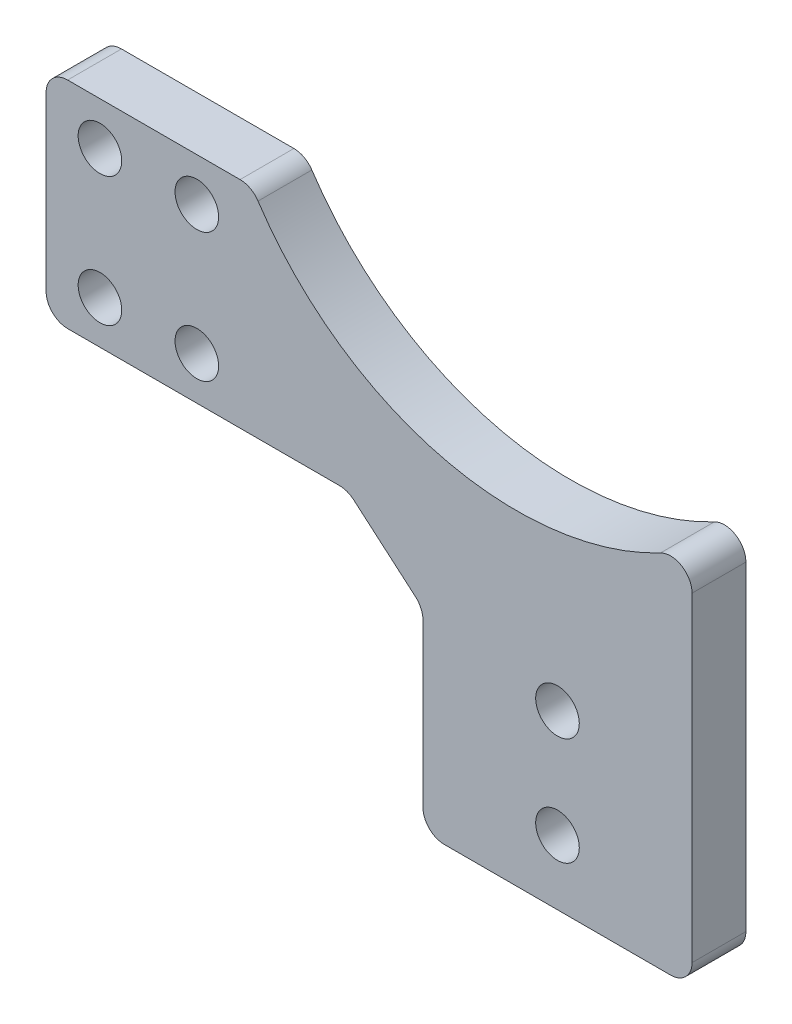
ISO-10303-21;
HEADER;
FILE_DESCRIPTION(('STEP AP214'),'2;1');
FILE_NAME('part.step','',(''),(''),'','','');
FILE_SCHEMA(('AUTOMOTIVE_DESIGN { 1 0 10303 214 1 1 1 1 }'));
ENDSEC;
DATA;
#1=APPLICATION_CONTEXT('core data for automotive mechanical design processes');
#2=APPLICATION_PROTOCOL_DEFINITION('international standard','automotive_design',2000,#1);
#3=PRODUCT_CONTEXT('',#1,'mechanical');
#4=PRODUCT('Part','Part','',(#3));
#5=PRODUCT_RELATED_PRODUCT_CATEGORY('part','',(#4));
#6=PRODUCT_DEFINITION_FORMATION('','',#4);
#7=PRODUCT_DEFINITION_CONTEXT('part definition',#1,'design');
#8=PRODUCT_DEFINITION('design','',#6,#7);
#9=PRODUCT_DEFINITION_SHAPE('','',#8);
#10=(LENGTH_UNIT() NAMED_UNIT(*) SI_UNIT(.MILLI.,.METRE.));
#11=(NAMED_UNIT(*) PLANE_ANGLE_UNIT() SI_UNIT($,.RADIAN.));
#12=(NAMED_UNIT(*) SI_UNIT($,.STERADIAN.) SOLID_ANGLE_UNIT());
#13=UNCERTAINTY_MEASURE_WITH_UNIT(LENGTH_MEASURE(1.E-05),#10,'distance_accuracy_value','');
#14=(GEOMETRIC_REPRESENTATION_CONTEXT(3) GLOBAL_UNCERTAINTY_ASSIGNED_CONTEXT((#13)) GLOBAL_UNIT_ASSIGNED_CONTEXT((#10,
#11,#12)) REPRESENTATION_CONTEXT('',''));
#15=CARTESIAN_POINT('',(0.,0.,0.));
#16=DIRECTION('',(0.,0.,1.));
#17=DIRECTION('',(1.,0.,0.));
#18=AXIS2_PLACEMENT_3D('',#15,#16,#17);
#19=CARTESIAN_POINT('',(-7.,6.,2.5));
#20=DIRECTION('',(0.650791373455969,0.759256602365296,0.));
#21=DIRECTION('',(-0.759256602365296,0.650791373455969,0.));
#22=AXIS2_PLACEMENT_3D('',#19,#20,#21);
#23=PLANE('',#22);
#24=DIRECTION('',(0.759256602365296,-0.650791373455969,0.));
#25=VECTOR('',#24,1.);
#26=CARTESIAN_POINT('',(-7.,6.,2.5));
#27=LINE('',#26,#25);
#28=CARTESIAN_POINT('',(-6.43826540551902,5.51851320473059,2.5));
#29=VERTEX_POINT('',#28);
#30=CARTESIAN_POINT('',(-0.698417253088064,0.598643359789769,2.5));
#31=VERTEX_POINT('',#30);
#32=EDGE_CURVE('E169',#29,#31,#27,.T.);
#33=ORIENTED_EDGE('',*,*,#32,.F.);
#34=DIRECTION('',(0.,0.,-1.));
#35=VECTOR('',#34,1.);
#36=CARTESIAN_POINT('',(-6.43826540551902,5.51851320473059,-2.5));
#37=LINE('',#36,#35);
#38=CARTESIAN_POINT('',(-6.43826540551902,5.51851320473059,-2.5));
#39=VERTEX_POINT('',#38);
#40=EDGE_CURVE('E155',#29,#39,#37,.T.);
#41=ORIENTED_EDGE('',*,*,#40,.T.);
#42=DIRECTION('',(0.759256602365296,-0.650791373455969,0.));
#43=VECTOR('',#42,1.);
#44=CARTESIAN_POINT('',(-7.,6.,-2.5));
#45=LINE('',#44,#43);
#46=CARTESIAN_POINT('',(-0.698417253088064,0.598643359789769,-2.5));
#47=VERTEX_POINT('',#46);
#48=EDGE_CURVE('E166',#39,#47,#45,.T.);
#49=ORIENTED_EDGE('',*,*,#48,.T.);
#50=DIRECTION('',(0.,0.,-1.));
#51=VECTOR('',#50,1.);
#52=CARTESIAN_POINT('',(-0.698417253088063,0.598643359789768,2.5));
#53=LINE('',#52,#51);
#54=EDGE_CURVE('E171',#47,#31,#53,.F.);
#55=ORIENTED_EDGE('',*,*,#54,.T.);
#56=EDGE_LOOP('',(#33,#41,#49,#55));
#57=FACE_BOUND('',#56,.T.);
#58=ADVANCED_FACE('F35',(#57),#23,.F.);
#59=CARTESIAN_POINT('',(0.,0.,2.5));
#60=DIRECTION('',(1.,0.,0.));
#61=DIRECTION('',(0.,1.,0.));
#62=AXIS2_PLACEMENT_3D('',#59,#60,#61);
#63=PLANE('',#62);
#64=DIRECTION('',(0.,-1.,0.));
#65=VECTOR('',#64,1.);
#66=CARTESIAN_POINT('',(0.,0.,-2.5));
#67=LINE('',#66,#65);
#68=CARTESIAN_POINT('',(0.,-0.919869844940825,-2.5));
#69=VERTEX_POINT('',#68);
#70=CARTESIAN_POINT('',(0.,-16.,-2.5));
#71=VERTEX_POINT('',#70);
#72=EDGE_CURVE('E176',#69,#71,#67,.T.);
#73=ORIENTED_EDGE('',*,*,#72,.T.);
#74=DIRECTION('',(0.,0.,1.));
#75=VECTOR('',#74,1.);
#76=CARTESIAN_POINT('',(0.,-16.,2.5));
#77=LINE('',#76,#75);
#78=CARTESIAN_POINT('',(0.,-16.,2.5));
#79=VERTEX_POINT('',#78);
#80=EDGE_CURVE('E11',#71,#79,#77,.T.);
#81=ORIENTED_EDGE('',*,*,#80,.T.);
#82=DIRECTION('',(0.,-1.,0.));
#83=VECTOR('',#82,1.);
#84=CARTESIAN_POINT('',(0.,0.,2.5));
#85=LINE('',#84,#83);
#86=CARTESIAN_POINT('',(0.,-0.919869844940825,2.5));
#87=VERTEX_POINT('',#86);
#88=EDGE_CURVE('E277',#87,#79,#85,.T.);
#89=ORIENTED_EDGE('',*,*,#88,.F.);
#90=DIRECTION('',(0.,0.,-1.));
#91=VECTOR('',#90,1.);
#92=CARTESIAN_POINT('',(0.,-0.919869844940825,-2.5));
#93=LINE('',#92,#91);
#94=EDGE_CURVE('E217',#87,#69,#93,.T.);
#95=ORIENTED_EDGE('',*,*,#94,.T.);
#96=EDGE_LOOP('',(#73,#81,#89,#95));
#97=FACE_BOUND('',#96,.T.);
#98=ADVANCED_FACE('F333',(#97),#63,.F.);
#99=CARTESIAN_POINT('',(25.,-24.,2.5));
#100=DIRECTION('',(-1.,0.,0.));
#101=DIRECTION('',(0.,-1.,0.));
#102=AXIS2_PLACEMENT_3D('',#99,#100,#101);
#103=PLANE('',#102);
#104=DIRECTION('',(0.,1.,0.));
#105=VECTOR('',#104,1.);
#106=CARTESIAN_POINT('',(25.,-24.,2.5));
#107=LINE('',#106,#105);
#108=CARTESIAN_POINT('',(25.,-16.,2.5));
#109=VERTEX_POINT('',#108);
#110=CARTESIAN_POINT('',(25.,13.7208871111981,2.5));
#111=VERTEX_POINT('',#110);
#112=EDGE_CURVE('E272',#109,#111,#107,.T.);
#113=ORIENTED_EDGE('',*,*,#112,.F.);
#114=DIRECTION('',(0.,0.,1.));
#115=VECTOR('',#114,1.);
#116=CARTESIAN_POINT('',(25.,-16.,2.5));
#117=LINE('',#116,#115);
#118=CARTESIAN_POINT('',(25.,-16.,-2.5));
#119=VERTEX_POINT('',#118);
#120=EDGE_CURVE('E58',#109,#119,#117,.F.);
#121=ORIENTED_EDGE('',*,*,#120,.T.);
#122=DIRECTION('',(0.,1.,0.));
#123=VECTOR('',#122,1.);
#124=CARTESIAN_POINT('',(25.,-24.,-2.5));
#125=LINE('',#124,#123);
#126=CARTESIAN_POINT('',(25.,13.7208871111981,-2.5));
#127=VERTEX_POINT('',#126);
#128=EDGE_CURVE('E179',#119,#127,#125,.T.);
#129=ORIENTED_EDGE('',*,*,#128,.T.);
#130=DIRECTION('',(0.,0.,-1.));
#131=VECTOR('',#130,1.);
#132=CARTESIAN_POINT('',(25.,13.7208871111981,2.5));
#133=LINE('',#132,#131);
#134=EDGE_CURVE('E236',#127,#111,#133,.F.);
#135=ORIENTED_EDGE('',*,*,#134,.T.);
#136=EDGE_LOOP('',(#113,#121,#129,#135));
#137=FACE_BOUND('',#136,.T.);
#138=ADVANCED_FACE('F273',(#137),#103,.F.);
#139=CARTESIAN_POINT('',(8.70000000000001,41.,2.5));
#140=DIRECTION('',(0.,0.,-1.));
#141=DIRECTION('',(-1.,0.,0.));
#142=AXIS2_PLACEMENT_3D('',#139,#140,#141);
#143=CYLINDRICAL_SURFACE('',#142,28.8);
#144=CARTESIAN_POINT('',(8.70000000000001,41.,2.5));
#145=DIRECTION('',(0.,0.,-1.));
#146=DIRECTION('',(-1.,0.,0.));
#147=AXIS2_PLACEMENT_3D('',#144,#145,#146);
#148=CIRCLE('',#147,28.8);
#149=CARTESIAN_POINT('',(22.0714285714286,15.4922580780034,2.5));
#150=VERTEX_POINT('',#149);
#151=CARTESIAN_POINT('',(-15.3157007169116,25.1038961038961,2.5));
#152=VERTEX_POINT('',#151);
#153=EDGE_CURVE('E276',#150,#152,#148,.T.);
#154=ORIENTED_EDGE('',*,*,#153,.F.);
#155=DIRECTION('',(0.,0.,-1.));
#156=VECTOR('',#155,1.);
#157=CARTESIAN_POINT('',(22.0714285714286,15.4922580780034,2.5));
#158=LINE('',#157,#156);
#159=CARTESIAN_POINT('',(22.0714285714286,15.4922580780034,-2.5));
#160=VERTEX_POINT('',#159);
#161=EDGE_CURVE('E228',#150,#160,#158,.T.);
#162=ORIENTED_EDGE('',*,*,#161,.T.);
#163=CARTESIAN_POINT('',(8.70000000000001,41.,-2.5));
#164=DIRECTION('',(0.,0.,-1.));
#165=DIRECTION('',(-1.,0.,0.));
#166=AXIS2_PLACEMENT_3D('',#163,#164,#165);
#167=CIRCLE('',#166,28.8);
#168=CARTESIAN_POINT('',(-15.3157007169116,25.1038961038961,-2.5));
#169=VERTEX_POINT('',#168);
#170=EDGE_CURVE('E189',#160,#169,#167,.T.);
#171=ORIENTED_EDGE('',*,*,#170,.T.);
#172=DIRECTION('',(0.,0.,-1.));
#173=VECTOR('',#172,1.);
#174=CARTESIAN_POINT('',(-15.3157007169116,25.1038961038961,2.5));
#175=LINE('',#174,#173);
#176=EDGE_CURVE('E226',#169,#152,#175,.F.);
#177=ORIENTED_EDGE('',*,*,#176,.T.);
#178=EDGE_LOOP('',(#154,#162,#171,#177));
#179=FACE_BOUND('',#178,.T.);
#180=ADVANCED_FACE('F318',(#179),#143,.F.);
#181=CARTESIAN_POINT('',(-15.8853614982575,26.,2.5));
#182=DIRECTION('',(0.,-1.,0.));
#183=DIRECTION('',(1.,0.,0.));
#184=AXIS2_PLACEMENT_3D('',#181,#182,#183);
#185=PLANE('',#184);
#186=DIRECTION('',(-1.,0.,0.));
#187=VECTOR('',#186,1.);
#188=CARTESIAN_POINT('',(-15.8853614982575,26.,2.5));
#189=LINE('',#188,#187);
#190=CARTESIAN_POINT('',(-16.9834577111416,26.,2.5));
#191=VERTEX_POINT('',#190);
#192=CARTESIAN_POINT('',(-33.,26.,2.5));
#193=VERTEX_POINT('',#192);
#194=EDGE_CURVE('E280',#191,#193,#189,.T.);
#195=ORIENTED_EDGE('',*,*,#194,.F.);
#196=DIRECTION('',(0.,0.,-1.));
#197=VECTOR('',#196,1.);
#198=CARTESIAN_POINT('',(-16.9834577111416,26.,2.5));
#199=LINE('',#198,#197);
#200=CARTESIAN_POINT('',(-16.9834577111416,26.,-2.5));
#201=VERTEX_POINT('',#200);
#202=EDGE_CURVE('E243',#191,#201,#199,.T.);
#203=ORIENTED_EDGE('',*,*,#202,.T.);
#204=DIRECTION('',(-1.,0.,0.));
#205=VECTOR('',#204,1.);
#206=CARTESIAN_POINT('',(-15.8853614982575,26.,-2.5));
#207=LINE('',#206,#205);
#208=CARTESIAN_POINT('',(-33.,26.,-2.5));
#209=VERTEX_POINT('',#208);
#210=EDGE_CURVE('E192',#201,#209,#207,.T.);
#211=ORIENTED_EDGE('',*,*,#210,.T.);
#212=DIRECTION('',(0.,0.,-1.));
#213=VECTOR('',#212,1.);
#214=CARTESIAN_POINT('',(-33.,26.,2.5));
#215=LINE('',#214,#213);
#216=EDGE_CURVE('E161',#209,#193,#215,.F.);
#217=ORIENTED_EDGE('',*,*,#216,.T.);
#218=EDGE_LOOP('',(#195,#203,#211,#217));
#219=FACE_BOUND('',#218,.T.);
#220=ADVANCED_FACE('F310',(#219),#185,.F.);
#221=CARTESIAN_POINT('',(-35.,26.,2.5));
#222=DIRECTION('',(1.,0.,0.));
#223=DIRECTION('',(0.,1.,0.));
#224=AXIS2_PLACEMENT_3D('',#221,#222,#223);
#225=PLANE('',#224);
#226=DIRECTION('',(0.,-1.,0.));
#227=VECTOR('',#226,1.);
#228=CARTESIAN_POINT('',(-35.,26.,-2.5));
#229=LINE('',#228,#227);
#230=CARTESIAN_POINT('',(-35.,24.,-2.5));
#231=VERTEX_POINT('',#230);
#232=CARTESIAN_POINT('',(-35.,8.,-2.5));
#233=VERTEX_POINT('',#232);
#234=EDGE_CURVE('E194',#231,#233,#229,.T.);
#235=ORIENTED_EDGE('',*,*,#234,.T.);
#236=DIRECTION('',(0.,0.,-1.));
#237=VECTOR('',#236,1.);
#238=CARTESIAN_POINT('',(-35.,8.,2.5));
#239=LINE('',#238,#237);
#240=CARTESIAN_POINT('',(-35.,8.,2.5));
#241=VERTEX_POINT('',#240);
#242=EDGE_CURVE('E211',#233,#241,#239,.F.);
#243=ORIENTED_EDGE('',*,*,#242,.T.);
#244=DIRECTION('',(0.,-1.,0.));
#245=VECTOR('',#244,1.);
#246=CARTESIAN_POINT('',(-35.,26.,2.5));
#247=LINE('',#246,#245);
#248=CARTESIAN_POINT('',(-35.,24.,2.5));
#249=VERTEX_POINT('',#248);
#250=EDGE_CURVE('E286',#249,#241,#247,.T.);
#251=ORIENTED_EDGE('',*,*,#250,.F.);
#252=DIRECTION('',(0.,0.,-1.));
#253=VECTOR('',#252,1.);
#254=CARTESIAN_POINT('',(-35.,24.,2.5));
#255=LINE('',#254,#253);
#256=EDGE_CURVE('E208',#249,#231,#255,.T.);
#257=ORIENTED_EDGE('',*,*,#256,.T.);
#258=EDGE_LOOP('',(#235,#243,#251,#257));
#259=FACE_BOUND('',#258,.T.);
#260=ADVANCED_FACE('F300',(#259),#225,.F.);
#261=CARTESIAN_POINT('',(-35.,6.,2.5));
#262=DIRECTION('',(0.,1.,0.));
#263=DIRECTION('',(0.,0.,1.));
#264=AXIS2_PLACEMENT_3D('',#261,#262,#263);
#265=PLANE('',#264);
#266=DIRECTION('',(1.,0.,0.));
#267=VECTOR('',#266,1.);
#268=CARTESIAN_POINT('',(-35.,6.,-2.5));
#269=LINE('',#268,#267);
#270=CARTESIAN_POINT('',(-33.,6.,-2.5));
#271=VERTEX_POINT('',#270);
#272=CARTESIAN_POINT('',(-7.73984815243096,6.,-2.5));
#273=VERTEX_POINT('',#272);
#274=EDGE_CURVE('E197',#271,#273,#269,.T.);
#275=ORIENTED_EDGE('',*,*,#274,.T.);
#276=DIRECTION('',(0.,0.,-1.));
#277=VECTOR('',#276,1.);
#278=CARTESIAN_POINT('',(-7.73984815243096,6.,2.5));
#279=LINE('',#278,#277);
#280=CARTESIAN_POINT('',(-7.73984815243096,6.,2.5));
#281=VERTEX_POINT('',#280);
#282=EDGE_CURVE('E156',#273,#281,#279,.F.);
#283=ORIENTED_EDGE('',*,*,#282,.T.);
#284=DIRECTION('',(1.,0.,0.));
#285=VECTOR('',#284,1.);
#286=CARTESIAN_POINT('',(-35.,6.,2.5));
#287=LINE('',#286,#285);
#288=CARTESIAN_POINT('',(-33.,6.,2.5));
#289=VERTEX_POINT('',#288);
#290=EDGE_CURVE('E185',#289,#281,#287,.T.);
#291=ORIENTED_EDGE('',*,*,#290,.F.);
#292=DIRECTION('',(0.,0.,-1.));
#293=VECTOR('',#292,1.);
#294=CARTESIAN_POINT('',(-33.,6.,2.5));
#295=LINE('',#294,#293);
#296=EDGE_CURVE('E170',#289,#271,#295,.T.);
#297=ORIENTED_EDGE('',*,*,#296,.T.);
#298=EDGE_LOOP('',(#275,#283,#291,#297));
#299=FACE_BOUND('',#298,.T.);
#300=ADVANCED_FACE('F294',(#299),#265,.F.);
#301=CARTESIAN_POINT('',(8.70000000000001,41.,2.5));
#302=DIRECTION('',(0.,0.,-1.));
#303=DIRECTION('',(-1.,0.,0.));
#304=AXIS2_PLACEMENT_3D('',#301,#302,#303);
#305=PLANE('',#304);
#306=CARTESIAN_POINT('',(-21.,10.,2.5));
#307=DIRECTION('',(0.,0.,1.));
#308=DIRECTION('',(1.,0.,0.));
#309=AXIS2_PLACEMENT_3D('',#306,#307,#308);
#310=CIRCLE('',#309,2.025);
#311=CARTESIAN_POINT('',(-18.975,10.,2.5));
#312=VERTEX_POINT('',#311);
#313=EDGE_CURVE('E534',#312,#312,#310,.T.);
#314=ORIENTED_EDGE('',*,*,#313,.F.);
#315=EDGE_LOOP('',(#314));
#316=FACE_BOUND('',#315,.T.);
#317=CARTESIAN_POINT('',(-21.,22.,2.5));
#318=DIRECTION('',(0.,0.,1.));
#319=DIRECTION('',(1.,0.,0.));
#320=AXIS2_PLACEMENT_3D('',#317,#318,#319);
#321=CIRCLE('',#320,2.025);
#322=CARTESIAN_POINT('',(-18.975,22.,2.5));
#323=VERTEX_POINT('',#322);
#324=EDGE_CURVE('E540',#323,#323,#321,.T.);
#325=ORIENTED_EDGE('',*,*,#324,.F.);
#326=EDGE_LOOP('',(#325));
#327=FACE_BOUND('',#326,.T.);
#328=CARTESIAN_POINT('',(-30.,22.,2.5));
#329=DIRECTION('',(0.,0.,-1.));
#330=DIRECTION('',(-1.,0.,0.));
#331=AXIS2_PLACEMENT_3D('',#328,#329,#330);
#332=CIRCLE('',#331,2.025);
#333=CARTESIAN_POINT('',(-32.025,22.,2.5));
#334=VERTEX_POINT('',#333);
#335=EDGE_CURVE('E355',#334,#334,#332,.T.);
#336=ORIENTED_EDGE('',*,*,#335,.T.);
#337=EDGE_LOOP('',(#336));
#338=FACE_BOUND('',#337,.T.);
#339=CARTESIAN_POINT('',(-30.,10.,2.5));
#340=DIRECTION('',(0.,0.,-1.));
#341=DIRECTION('',(-1.,0.,0.));
#342=AXIS2_PLACEMENT_3D('',#339,#340,#341);
#343=CIRCLE('',#342,2.025);
#344=CARTESIAN_POINT('',(-32.025,10.,2.5));
#345=VERTEX_POINT('',#344);
#346=EDGE_CURVE('E358',#345,#345,#343,.T.);
#347=ORIENTED_EDGE('',*,*,#346,.T.);
#348=EDGE_LOOP('',(#347));
#349=FACE_BOUND('',#348,.T.);
#350=CARTESIAN_POINT('',(12.5,-2.,2.5));
#351=DIRECTION('',(0.,0.,1.));
#352=DIRECTION('',(1.,0.,0.));
#353=AXIS2_PLACEMENT_3D('',#350,#351,#352);
#354=CIRCLE('',#353,2.025);
#355=CARTESIAN_POINT('',(14.525,-2.,2.5));
#356=VERTEX_POINT('',#355);
#357=EDGE_CURVE('E182',#356,#356,#354,.T.);
#358=ORIENTED_EDGE('',*,*,#357,.F.);
#359=EDGE_LOOP('',(#358));
#360=FACE_BOUND('',#359,.T.);
#361=CARTESIAN_POINT('',(12.5,-12.,2.5));
#362=DIRECTION('',(0.,0.,1.));
#363=DIRECTION('',(1.,0.,0.));
#364=AXIS2_PLACEMENT_3D('',#361,#362,#363);
#365=CIRCLE('',#364,2.025);
#366=CARTESIAN_POINT('',(14.525,-12.,2.5));
#367=VERTEX_POINT('',#366);
#368=EDGE_CURVE('E266',#367,#367,#365,.T.);
#369=ORIENTED_EDGE('',*,*,#368,.F.);
#370=EDGE_LOOP('',(#369));
#371=FACE_BOUND('',#370,.T.);
#372=DIRECTION('',(-1.,0.,0.));
#373=VECTOR('',#372,1.);
#374=CARTESIAN_POINT('',(0.,-18.,2.5));
#375=LINE('',#374,#373);
#376=CARTESIAN_POINT('',(23.,-18.,2.5));
#377=VERTEX_POINT('',#376);
#378=CARTESIAN_POINT('',(1.99999999999999,-18.,2.5));
#379=VERTEX_POINT('',#378);
#380=EDGE_CURVE('E267',#377,#379,#375,.T.);
#381=ORIENTED_EDGE('',*,*,#380,.F.);
#382=CARTESIAN_POINT('',(23.,-16.,2.5));
#383=DIRECTION('',(0.,0.,-1.));
#384=DIRECTION('',(-1.,0.,0.));
#385=AXIS2_PLACEMENT_3D('',#382,#383,#384);
#386=CIRCLE('',#385,2.);
#387=EDGE_CURVE('E253',#377,#109,#386,.F.);
#388=ORIENTED_EDGE('',*,*,#387,.T.);
#389=ORIENTED_EDGE('',*,*,#112,.T.);
#390=CARTESIAN_POINT('',(23.,13.7208871111981,2.5));
#391=DIRECTION('',(0.,0.,-1.));
#392=DIRECTION('',(-1.,0.,0.));
#393=AXIS2_PLACEMENT_3D('',#390,#391,#392);
#394=CIRCLE('',#393,2.);
#395=EDGE_CURVE('E241',#111,#150,#394,.F.);
#396=ORIENTED_EDGE('',*,*,#395,.T.);
#397=ORIENTED_EDGE('',*,*,#153,.T.);
#398=CARTESIAN_POINT('',(-16.9834577111416,24.,2.5));
#399=DIRECTION('',(0.,0.,-1.));
#400=DIRECTION('',(-1.,0.,0.));
#401=AXIS2_PLACEMENT_3D('',#398,#399,#400);
#402=CIRCLE('',#401,2.);
#403=EDGE_CURVE('E239',#152,#191,#402,.F.);
#404=ORIENTED_EDGE('',*,*,#403,.T.);
#405=ORIENTED_EDGE('',*,*,#194,.T.);
#406=CARTESIAN_POINT('',(-33.,24.,2.5));
#407=DIRECTION('',(0.,0.,-1.));
#408=DIRECTION('',(-1.,0.,0.));
#409=AXIS2_PLACEMENT_3D('',#406,#407,#408);
#410=CIRCLE('',#409,2.);
#411=EDGE_CURVE('E213',#193,#249,#410,.F.);
#412=ORIENTED_EDGE('',*,*,#411,.T.);
#413=ORIENTED_EDGE('',*,*,#250,.T.);
#414=CARTESIAN_POINT('',(-33.,8.,2.5));
#415=DIRECTION('',(0.,0.,-1.));
#416=DIRECTION('',(-1.,0.,0.));
#417=AXIS2_PLACEMENT_3D('',#414,#415,#416);
#418=CIRCLE('',#417,2.);
#419=EDGE_CURVE('E215',#241,#289,#418,.F.);
#420=ORIENTED_EDGE('',*,*,#419,.T.);
#421=ORIENTED_EDGE('',*,*,#290,.T.);
#422=CARTESIAN_POINT('',(-7.73984815243096,4.,2.5));
#423=DIRECTION('',(0.,0.,-1.));
#424=DIRECTION('',(-1.,0.,0.));
#425=AXIS2_PLACEMENT_3D('',#422,#423,#424);
#426=CIRCLE('',#425,2.);
#427=EDGE_CURVE('E160',#281,#29,#426,.T.);
#428=ORIENTED_EDGE('',*,*,#427,.T.);
#429=ORIENTED_EDGE('',*,*,#32,.T.);
#430=CARTESIAN_POINT('',(-2.,-0.919869844940825,2.5));
#431=DIRECTION('',(0.,0.,-1.));
#432=DIRECTION('',(-1.,0.,0.));
#433=AXIS2_PLACEMENT_3D('',#430,#431,#432);
#434=CIRCLE('',#433,2.);
#435=EDGE_CURVE('E224',#31,#87,#434,.T.);
#436=ORIENTED_EDGE('',*,*,#435,.T.);
#437=ORIENTED_EDGE('',*,*,#88,.T.);
#438=CARTESIAN_POINT('',(1.99999999999999,-16.,2.5));
#439=DIRECTION('',(0.,0.,-1.));
#440=DIRECTION('',(-1.,0.,0.));
#441=AXIS2_PLACEMENT_3D('',#438,#439,#440);
#442=CIRCLE('',#441,2.);
#443=EDGE_CURVE('E251',#79,#379,#442,.F.);
#444=ORIENTED_EDGE('',*,*,#443,.T.);
#445=EDGE_LOOP('',(#381,#388,#389,#396,#397,#404,#405,#412,#413,#420,#421,#428,#429,#436,#437,#444));
#446=FACE_BOUND('',#445,.T.);
#447=ADVANCED_FACE('F271',(#316,#327,#338,#349,#360,#371,#446),#305,.F.);
#448=CARTESIAN_POINT('',(8.70000000000001,41.,-2.5));
#449=DIRECTION('',(0.,0.,-1.));
#450=DIRECTION('',(-1.,0.,0.));
#451=AXIS2_PLACEMENT_3D('',#448,#449,#450);
#452=PLANE('',#451);
#453=CARTESIAN_POINT('',(-21.,10.,-2.5));
#454=DIRECTION('',(0.,0.,1.));
#455=DIRECTION('',(1.,0.,0.));
#456=AXIS2_PLACEMENT_3D('',#453,#454,#455);
#457=CIRCLE('',#456,2.025);
#458=CARTESIAN_POINT('',(-18.975,10.,-2.5));
#459=VERTEX_POINT('',#458);
#460=EDGE_CURVE('E532',#459,#459,#457,.T.);
#461=ORIENTED_EDGE('',*,*,#460,.T.);
#462=EDGE_LOOP('',(#461));
#463=FACE_BOUND('',#462,.T.);
#464=CARTESIAN_POINT('',(-21.,22.,-2.5));
#465=DIRECTION('',(0.,0.,1.));
#466=DIRECTION('',(1.,0.,0.));
#467=AXIS2_PLACEMENT_3D('',#464,#465,#466);
#468=CIRCLE('',#467,2.025);
#469=CARTESIAN_POINT('',(-18.975,22.,-2.5));
#470=VERTEX_POINT('',#469);
#471=EDGE_CURVE('E535',#470,#470,#468,.T.);
#472=ORIENTED_EDGE('',*,*,#471,.T.);
#473=EDGE_LOOP('',(#472));
#474=FACE_BOUND('',#473,.T.);
#475=CARTESIAN_POINT('',(-30.,22.,-2.5));
#476=DIRECTION('',(0.,0.,1.));
#477=DIRECTION('',(1.,0.,0.));
#478=AXIS2_PLACEMENT_3D('',#475,#476,#477);
#479=CIRCLE('',#478,2.025);
#480=CARTESIAN_POINT('',(-27.975,22.,-2.5));
#481=VERTEX_POINT('',#480);
#482=EDGE_CURVE('E545',#481,#481,#479,.T.);
#483=ORIENTED_EDGE('',*,*,#482,.T.);
#484=EDGE_LOOP('',(#483));
#485=FACE_BOUND('',#484,.T.);
#486=CARTESIAN_POINT('',(-30.,10.,-2.5));
#487=DIRECTION('',(0.,0.,1.));
#488=DIRECTION('',(1.,0.,0.));
#489=AXIS2_PLACEMENT_3D('',#486,#487,#488);
#490=CIRCLE('',#489,2.025);
#491=CARTESIAN_POINT('',(-27.975,10.,-2.5));
#492=VERTEX_POINT('',#491);
#493=EDGE_CURVE('E537',#492,#492,#490,.T.);
#494=ORIENTED_EDGE('',*,*,#493,.T.);
#495=EDGE_LOOP('',(#494));
#496=FACE_BOUND('',#495,.T.);
#497=ORIENTED_EDGE('',*,*,#128,.F.);
#498=CARTESIAN_POINT('',(23.,-16.,-2.5));
#499=DIRECTION('',(0.,0.,-1.));
#500=DIRECTION('',(-1.,0.,0.));
#501=AXIS2_PLACEMENT_3D('',#498,#499,#500);
#502=CIRCLE('',#501,2.);
#503=CARTESIAN_POINT('',(23.,-18.,-2.5));
#504=VERTEX_POINT('',#503);
#505=EDGE_CURVE('E43',#119,#504,#502,.T.);
#506=ORIENTED_EDGE('',*,*,#505,.T.);
#507=DIRECTION('',(-1.,0.,0.));
#508=VECTOR('',#507,1.);
#509=CARTESIAN_POINT('',(0.,-18.,-2.5));
#510=LINE('',#509,#508);
#511=CARTESIAN_POINT('',(1.99999999999999,-18.,-2.5));
#512=VERTEX_POINT('',#511);
#513=EDGE_CURVE('E258',#504,#512,#510,.T.);
#514=ORIENTED_EDGE('',*,*,#513,.T.);
#515=CARTESIAN_POINT('',(1.99999999999999,-16.,-2.5));
#516=DIRECTION('',(0.,0.,-1.));
#517=DIRECTION('',(-1.,0.,0.));
#518=AXIS2_PLACEMENT_3D('',#515,#516,#517);
#519=CIRCLE('',#518,2.);
#520=EDGE_CURVE('E50',#512,#71,#519,.T.);
#521=ORIENTED_EDGE('',*,*,#520,.T.);
#522=ORIENTED_EDGE('',*,*,#72,.F.);
#523=CARTESIAN_POINT('',(-2.,-0.919869844940825,-2.5));
#524=DIRECTION('',(0.,0.,-1.));
#525=DIRECTION('',(-1.,0.,0.));
#526=AXIS2_PLACEMENT_3D('',#523,#524,#525);
#527=CIRCLE('',#526,2.);
#528=EDGE_CURVE('E175',#69,#47,#527,.F.);
#529=ORIENTED_EDGE('',*,*,#528,.T.);
#530=ORIENTED_EDGE('',*,*,#48,.F.);
#531=CARTESIAN_POINT('',(-7.73984815243096,4.,-2.5));
#532=DIRECTION('',(0.,0.,-1.));
#533=DIRECTION('',(-1.,0.,0.));
#534=AXIS2_PLACEMENT_3D('',#531,#532,#533);
#535=CIRCLE('',#534,2.);
#536=EDGE_CURVE('E151',#39,#273,#535,.F.);
#537=ORIENTED_EDGE('',*,*,#536,.T.);
#538=ORIENTED_EDGE('',*,*,#274,.F.);
#539=CARTESIAN_POINT('',(-33.,8.,-2.5));
#540=DIRECTION('',(0.,0.,-1.));
#541=DIRECTION('',(-1.,0.,0.));
#542=AXIS2_PLACEMENT_3D('',#539,#540,#541);
#543=CIRCLE('',#542,2.);
#544=EDGE_CURVE('E206',#271,#233,#543,.T.);
#545=ORIENTED_EDGE('',*,*,#544,.T.);
#546=ORIENTED_EDGE('',*,*,#234,.F.);
#547=CARTESIAN_POINT('',(-33.,24.,-2.5));
#548=DIRECTION('',(0.,0.,-1.));
#549=DIRECTION('',(-1.,0.,0.));
#550=AXIS2_PLACEMENT_3D('',#547,#548,#549);
#551=CIRCLE('',#550,2.);
#552=EDGE_CURVE('E203',#231,#209,#551,.T.);
#553=ORIENTED_EDGE('',*,*,#552,.T.);
#554=ORIENTED_EDGE('',*,*,#210,.F.);
#555=CARTESIAN_POINT('',(-16.9834577111416,24.,-2.5));
#556=DIRECTION('',(0.,0.,-1.));
#557=DIRECTION('',(-1.,0.,0.));
#558=AXIS2_PLACEMENT_3D('',#555,#556,#557);
#559=CIRCLE('',#558,2.);
#560=EDGE_CURVE('E231',#201,#169,#559,.T.);
#561=ORIENTED_EDGE('',*,*,#560,.T.);
#562=ORIENTED_EDGE('',*,*,#170,.F.);
#563=CARTESIAN_POINT('',(23.,13.7208871111981,-2.5));
#564=DIRECTION('',(0.,0.,-1.));
#565=DIRECTION('',(-1.,0.,0.));
#566=AXIS2_PLACEMENT_3D('',#563,#564,#565);
#567=CIRCLE('',#566,2.);
#568=EDGE_CURVE('E233',#160,#127,#567,.T.);
#569=ORIENTED_EDGE('',*,*,#568,.T.);
#570=EDGE_LOOP('',(#497,#506,#514,#521,#522,#529,#530,#537,#538,#545,#546,#553,#554,#561,#562,#569));
#571=FACE_BOUND('',#570,.T.);
#572=CARTESIAN_POINT('',(12.5,-2.,-2.5));
#573=DIRECTION('',(0.,0.,1.));
#574=DIRECTION('',(1.,0.,0.));
#575=AXIS2_PLACEMENT_3D('',#572,#573,#574);
#576=CIRCLE('',#575,2.025);
#577=CARTESIAN_POINT('',(14.525,-2.,-2.5));
#578=VERTEX_POINT('',#577);
#579=EDGE_CURVE('E177',#578,#578,#576,.T.);
#580=ORIENTED_EDGE('',*,*,#579,.T.);
#581=EDGE_LOOP('',(#580));
#582=FACE_BOUND('',#581,.T.);
#583=CARTESIAN_POINT('',(12.5,-12.,-2.5));
#584=DIRECTION('',(0.,0.,1.));
#585=DIRECTION('',(1.,0.,0.));
#586=AXIS2_PLACEMENT_3D('',#583,#584,#585);
#587=CIRCLE('',#586,2.025);
#588=CARTESIAN_POINT('',(14.525,-12.,-2.5));
#589=VERTEX_POINT('',#588);
#590=EDGE_CURVE('E363',#589,#589,#587,.T.);
#591=ORIENTED_EDGE('',*,*,#590,.T.);
#592=EDGE_LOOP('',(#591));
#593=FACE_BOUND('',#592,.T.);
#594=ADVANCED_FACE('F173',(#463,#474,#485,#496,#571,#582,#593),#452,.T.);
#595=CARTESIAN_POINT('',(-7.73984815243096,4.,2.5));
#596=DIRECTION('',(0.,0.,1.));
#597=DIRECTION('',(1.,0.,0.));
#598=AXIS2_PLACEMENT_3D('',#595,#596,#597);
#599=CYLINDRICAL_SURFACE('',#598,2.);
#600=ORIENTED_EDGE('',*,*,#427,.F.);
#601=ORIENTED_EDGE('',*,*,#282,.F.);
#602=ORIENTED_EDGE('',*,*,#536,.F.);
#603=ORIENTED_EDGE('',*,*,#40,.F.);
#604=EDGE_LOOP('',(#600,#601,#602,#603));
#605=FACE_BOUND('',#604,.T.);
#606=ADVANCED_FACE('F154',(#605),#599,.F.);
#607=CARTESIAN_POINT('',(-33.,8.,2.5));
#608=DIRECTION('',(0.,0.,-1.));
#609=DIRECTION('',(-1.,0.,0.));
#610=AXIS2_PLACEMENT_3D('',#607,#608,#609);
#611=CYLINDRICAL_SURFACE('',#610,2.);
#612=ORIENTED_EDGE('',*,*,#419,.F.);
#613=ORIENTED_EDGE('',*,*,#242,.F.);
#614=ORIENTED_EDGE('',*,*,#544,.F.);
#615=ORIENTED_EDGE('',*,*,#296,.F.);
#616=EDGE_LOOP('',(#612,#613,#614,#615));
#617=FACE_BOUND('',#616,.T.);
#618=ADVANCED_FACE('F296',(#617),#611,.T.);
#619=CARTESIAN_POINT('',(-2.,-0.919869844940825,2.5));
#620=DIRECTION('',(0.,0.,1.));
#621=DIRECTION('',(1.,0.,0.));
#622=AXIS2_PLACEMENT_3D('',#619,#620,#621);
#623=CYLINDRICAL_SURFACE('',#622,2.);
#624=ORIENTED_EDGE('',*,*,#435,.F.);
#625=ORIENTED_EDGE('',*,*,#54,.F.);
#626=ORIENTED_EDGE('',*,*,#528,.F.);
#627=ORIENTED_EDGE('',*,*,#94,.F.);
#628=EDGE_LOOP('',(#624,#625,#626,#627));
#629=FACE_BOUND('',#628,.T.);
#630=ADVANCED_FACE('F330',(#629),#623,.F.);
#631=CARTESIAN_POINT('',(-33.,24.,2.5));
#632=DIRECTION('',(0.,0.,-1.));
#633=DIRECTION('',(-1.,0.,0.));
#634=AXIS2_PLACEMENT_3D('',#631,#632,#633);
#635=CYLINDRICAL_SURFACE('',#634,2.);
#636=ORIENTED_EDGE('',*,*,#411,.F.);
#637=ORIENTED_EDGE('',*,*,#216,.F.);
#638=ORIENTED_EDGE('',*,*,#552,.F.);
#639=ORIENTED_EDGE('',*,*,#256,.F.);
#640=EDGE_LOOP('',(#636,#637,#638,#639));
#641=FACE_BOUND('',#640,.T.);
#642=ADVANCED_FACE('F304',(#641),#635,.T.);
#643=CARTESIAN_POINT('',(23.,13.7208871111981,2.5));
#644=DIRECTION('',(0.,0.,-1.));
#645=DIRECTION('',(-1.,0.,0.));
#646=AXIS2_PLACEMENT_3D('',#643,#644,#645);
#647=CYLINDRICAL_SURFACE('',#646,2.);
#648=ORIENTED_EDGE('',*,*,#395,.F.);
#649=ORIENTED_EDGE('',*,*,#134,.F.);
#650=ORIENTED_EDGE('',*,*,#568,.F.);
#651=ORIENTED_EDGE('',*,*,#161,.F.);
#652=EDGE_LOOP('',(#648,#649,#650,#651));
#653=FACE_BOUND('',#652,.T.);
#654=ADVANCED_FACE('F321',(#653),#647,.T.);
#655=CARTESIAN_POINT('',(-16.9834577111416,24.,2.5));
#656=DIRECTION('',(0.,0.,-1.));
#657=DIRECTION('',(-1.,0.,0.));
#658=AXIS2_PLACEMENT_3D('',#655,#656,#657);
#659=CYLINDRICAL_SURFACE('',#658,2.);
#660=ORIENTED_EDGE('',*,*,#403,.F.);
#661=ORIENTED_EDGE('',*,*,#176,.F.);
#662=ORIENTED_EDGE('',*,*,#560,.F.);
#663=ORIENTED_EDGE('',*,*,#202,.F.);
#664=EDGE_LOOP('',(#660,#661,#662,#663));
#665=FACE_BOUND('',#664,.T.);
#666=ADVANCED_FACE('F314',(#665),#659,.T.);
#667=CARTESIAN_POINT('',(12.5,-12.,-2.5));
#668=DIRECTION('',(0.,0.,1.));
#669=DIRECTION('',(1.,0.,0.));
#670=AXIS2_PLACEMENT_3D('',#667,#668,#669);
#671=CYLINDRICAL_SURFACE('',#670,2.025);
#672=ORIENTED_EDGE('',*,*,#590,.F.);
#673=EDGE_LOOP('',(#672));
#674=FACE_BOUND('',#673,.T.);
#675=ORIENTED_EDGE('',*,*,#368,.T.);
#676=EDGE_LOOP('',(#675));
#677=FACE_BOUND('',#676,.T.);
#678=ADVANCED_FACE('F328',(#674,#677),#671,.F.);
#679=CARTESIAN_POINT('',(12.5,-2.,-2.5));
#680=DIRECTION('',(0.,0.,1.));
#681=DIRECTION('',(1.,0.,0.));
#682=AXIS2_PLACEMENT_3D('',#679,#680,#681);
#683=CYLINDRICAL_SURFACE('',#682,2.025);
#684=ORIENTED_EDGE('',*,*,#579,.F.);
#685=EDGE_LOOP('',(#684));
#686=FACE_BOUND('',#685,.T.);
#687=ORIENTED_EDGE('',*,*,#357,.T.);
#688=EDGE_LOOP('',(#687));
#689=FACE_BOUND('',#688,.T.);
#690=ADVANCED_FACE('F455',(#686,#689),#683,.F.);
#691=CARTESIAN_POINT('',(0.,-18.,-2.5));
#692=DIRECTION('',(0.,1.,0.));
#693=DIRECTION('',(0.,0.,1.));
#694=AXIS2_PLACEMENT_3D('',#691,#692,#693);
#695=PLANE('',#694);
#696=ORIENTED_EDGE('',*,*,#513,.F.);
#697=DIRECTION('',(0.,0.,1.));
#698=VECTOR('',#697,1.);
#699=CARTESIAN_POINT('',(23.,-18.,-2.5));
#700=LINE('',#699,#698);
#701=EDGE_CURVE('E248',#504,#377,#700,.T.);
#702=ORIENTED_EDGE('',*,*,#701,.T.);
#703=ORIENTED_EDGE('',*,*,#380,.T.);
#704=DIRECTION('',(0.,0.,1.));
#705=VECTOR('',#704,1.);
#706=CARTESIAN_POINT('',(1.99999999999999,-18.,-2.5));
#707=LINE('',#706,#705);
#708=EDGE_CURVE('E246',#379,#512,#707,.F.);
#709=ORIENTED_EDGE('',*,*,#708,.T.);
#710=EDGE_LOOP('',(#696,#702,#703,#709));
#711=FACE_BOUND('',#710,.T.);
#712=ADVANCED_FACE('F262',(#711),#695,.F.);
#713=CARTESIAN_POINT('',(23.,-16.,-2.5));
#714=DIRECTION('',(0.,0.,1.));
#715=DIRECTION('',(1.,0.,0.));
#716=AXIS2_PLACEMENT_3D('',#713,#714,#715);
#717=CYLINDRICAL_SURFACE('',#716,2.);
#718=ORIENTED_EDGE('',*,*,#505,.F.);
#719=ORIENTED_EDGE('',*,*,#120,.F.);
#720=ORIENTED_EDGE('',*,*,#387,.F.);
#721=ORIENTED_EDGE('',*,*,#701,.F.);
#722=EDGE_LOOP('',(#718,#719,#720,#721));
#723=FACE_BOUND('',#722,.T.);
#724=ADVANCED_FACE('F269',(#723),#717,.T.);
#725=CARTESIAN_POINT('',(1.99999999999999,-16.,2.5));
#726=DIRECTION('',(0.,0.,1.));
#727=DIRECTION('',(1.,0.,0.));
#728=AXIS2_PLACEMENT_3D('',#725,#726,#727);
#729=CYLINDRICAL_SURFACE('',#728,2.);
#730=ORIENTED_EDGE('',*,*,#520,.F.);
#731=ORIENTED_EDGE('',*,*,#708,.F.);
#732=ORIENTED_EDGE('',*,*,#443,.F.);
#733=ORIENTED_EDGE('',*,*,#80,.F.);
#734=EDGE_LOOP('',(#730,#731,#732,#733));
#735=FACE_BOUND('',#734,.T.);
#736=ADVANCED_FACE('F37',(#735),#729,.T.);
#737=CARTESIAN_POINT('',(-30.,10.,-2.5));
#738=DIRECTION('',(0.,0.,1.));
#739=DIRECTION('',(1.,0.,0.));
#740=AXIS2_PLACEMENT_3D('',#737,#738,#739);
#741=CYLINDRICAL_SURFACE('',#740,2.025);
#742=ORIENTED_EDGE('',*,*,#493,.F.);
#743=EDGE_LOOP('',(#742));
#744=FACE_BOUND('',#743,.T.);
#745=ORIENTED_EDGE('',*,*,#346,.F.);
#746=EDGE_LOOP('',(#745));
#747=FACE_BOUND('',#746,.T.);
#748=ADVANCED_FACE('F482',(#744,#747),#741,.F.);
#749=CARTESIAN_POINT('',(-30.,22.,-2.5));
#750=DIRECTION('',(0.,0.,1.));
#751=DIRECTION('',(1.,0.,0.));
#752=AXIS2_PLACEMENT_3D('',#749,#750,#751);
#753=CYLINDRICAL_SURFACE('',#752,2.025);
#754=ORIENTED_EDGE('',*,*,#482,.F.);
#755=EDGE_LOOP('',(#754));
#756=FACE_BOUND('',#755,.T.);
#757=ORIENTED_EDGE('',*,*,#335,.F.);
#758=EDGE_LOOP('',(#757));
#759=FACE_BOUND('',#758,.T.);
#760=ADVANCED_FACE('F489',(#756,#759),#753,.F.);
#761=CARTESIAN_POINT('',(-21.,22.,-2.5));
#762=DIRECTION('',(0.,0.,1.));
#763=DIRECTION('',(1.,0.,0.));
#764=AXIS2_PLACEMENT_3D('',#761,#762,#763);
#765=CYLINDRICAL_SURFACE('',#764,2.025);
#766=ORIENTED_EDGE('',*,*,#471,.F.);
#767=EDGE_LOOP('',(#766));
#768=FACE_BOUND('',#767,.T.);
#769=ORIENTED_EDGE('',*,*,#324,.T.);
#770=EDGE_LOOP('',(#769));
#771=FACE_BOUND('',#770,.T.);
#772=ADVANCED_FACE('F498',(#768,#771),#765,.F.);
#773=CARTESIAN_POINT('',(-21.,10.,-2.5));
#774=DIRECTION('',(0.,0.,1.));
#775=DIRECTION('',(1.,0.,0.));
#776=AXIS2_PLACEMENT_3D('',#773,#774,#775);
#777=CYLINDRICAL_SURFACE('',#776,2.025);
#778=ORIENTED_EDGE('',*,*,#460,.F.);
#779=EDGE_LOOP('',(#778));
#780=FACE_BOUND('',#779,.T.);
#781=ORIENTED_EDGE('',*,*,#313,.T.);
#782=EDGE_LOOP('',(#781));
#783=FACE_BOUND('',#782,.T.);
#784=ADVANCED_FACE('F507',(#780,#783),#777,.F.);
#785=CLOSED_SHELL('',(#58,#98,#138,#180,#220,#260,#300,#447,#594,#606,#618,#630,#642,#654,#666,
#678,#690,#712,#724,#736,#748,#760,#772,#784));
#786=MANIFOLD_SOLID_BREP('B2',#785);
#787=ADVANCED_BREP_SHAPE_REPRESENTATION('',(#18,#786),#14);
#788=SHAPE_DEFINITION_REPRESENTATION(#9,#787);
ENDSEC;
END-ISO-10303-21;
